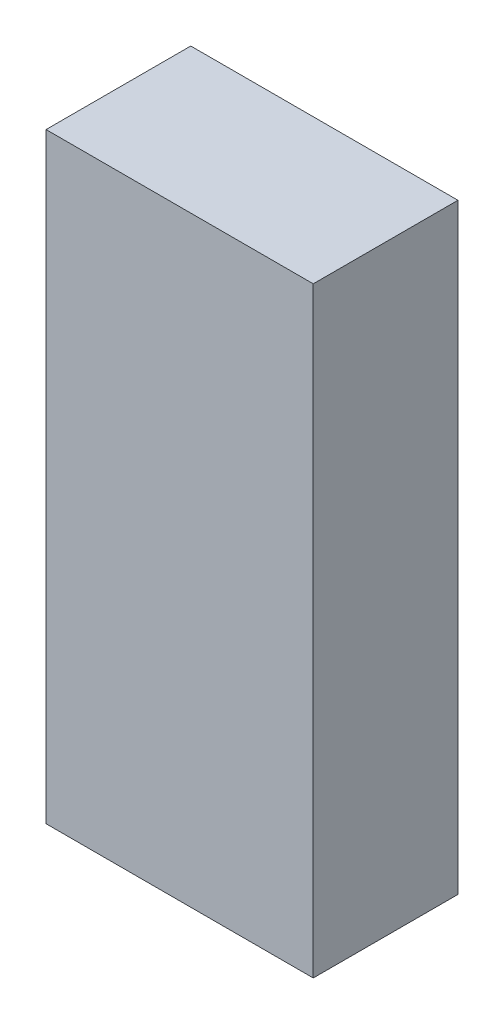
ISO-10303-21;
HEADER;
FILE_DESCRIPTION(('STEP AP214'),'2;1');
FILE_NAME('part.step','',(''),(''),'','','');
FILE_SCHEMA(('AUTOMOTIVE_DESIGN { 1 0 10303 214 1 1 1 1 }'));
ENDSEC;
DATA;
#1=APPLICATION_CONTEXT('core data for automotive mechanical design processes');
#2=APPLICATION_PROTOCOL_DEFINITION('international standard','automotive_design',2000,#1);
#3=PRODUCT_CONTEXT('',#1,'mechanical');
#4=PRODUCT('Part','Part','',(#3));
#5=PRODUCT_RELATED_PRODUCT_CATEGORY('part','',(#4));
#6=PRODUCT_DEFINITION_FORMATION('','',#4);
#7=PRODUCT_DEFINITION_CONTEXT('part definition',#1,'design');
#8=PRODUCT_DEFINITION('design','',#6,#7);
#9=PRODUCT_DEFINITION_SHAPE('','',#8);
#10=(LENGTH_UNIT() NAMED_UNIT(*) SI_UNIT(.MILLI.,.METRE.));
#11=(NAMED_UNIT(*) PLANE_ANGLE_UNIT() SI_UNIT($,.RADIAN.));
#12=(NAMED_UNIT(*) SI_UNIT($,.STERADIAN.) SOLID_ANGLE_UNIT());
#13=UNCERTAINTY_MEASURE_WITH_UNIT(LENGTH_MEASURE(1.E-05),#10,'distance_accuracy_value','');
#14=(GEOMETRIC_REPRESENTATION_CONTEXT(3) GLOBAL_UNCERTAINTY_ASSIGNED_CONTEXT((#13)) GLOBAL_UNIT_ASSIGNED_CONTEXT((#10,
#11,#12)) REPRESENTATION_CONTEXT('',''));
#15=CARTESIAN_POINT('',(0.,0.,0.));
#16=DIRECTION('',(0.,0.,1.));
#17=DIRECTION('',(1.,0.,0.));
#18=AXIS2_PLACEMENT_3D('',#15,#16,#17);
#19=CARTESIAN_POINT('',(0.738632,-1.661922,0.80000094));
#20=DIRECTION('',(0.,0.,1.));
#21=DIRECTION('',(1.,0.,0.));
#22=AXIS2_PLACEMENT_3D('',#19,#20,#21);
#23=PLANE('',#22);
#24=DIRECTION('',(0.,1.,0.));
#25=VECTOR('',#24,1.);
#26=CARTESIAN_POINT('',(-0.738632,-1.661922,0.80000094));
#27=LINE('',#26,#25);
#28=CARTESIAN_POINT('',(-0.738632,-1.661922,0.80000094));
#29=VERTEX_POINT('',#28);
#30=CARTESIAN_POINT('',(-0.738632,1.661922,0.80000094));
#31=VERTEX_POINT('',#30);
#32=EDGE_CURVE('E53',#29,#31,#27,.T.);
#33=ORIENTED_EDGE('',*,*,#32,.F.);
#34=DIRECTION('',(1.,0.,0.));
#35=VECTOR('',#34,1.);
#36=CARTESIAN_POINT('',(0.738632,-1.661922,0.80000094));
#37=LINE('',#36,#35);
#38=CARTESIAN_POINT('',(0.738632,-1.661922,0.80000094));
#39=VERTEX_POINT('',#38);
#40=EDGE_CURVE('E20',#29,#39,#37,.T.);
#41=ORIENTED_EDGE('',*,*,#40,.T.);
#42=DIRECTION('',(0.,1.,0.));
#43=VECTOR('',#42,1.);
#44=CARTESIAN_POINT('',(0.738632,1.661922,0.80000094));
#45=LINE('',#44,#43);
#46=CARTESIAN_POINT('',(0.738632,1.661922,0.80000094));
#47=VERTEX_POINT('',#46);
#48=EDGE_CURVE('E67',#47,#39,#45,.F.);
#49=ORIENTED_EDGE('',*,*,#48,.F.);
#50=DIRECTION('',(1.,0.,0.));
#51=VECTOR('',#50,1.);
#52=CARTESIAN_POINT('',(-0.738632,1.661922,0.80000094));
#53=LINE('',#52,#51);
#54=EDGE_CURVE('E58',#31,#47,#53,.T.);
#55=ORIENTED_EDGE('',*,*,#54,.F.);
#56=EDGE_LOOP('',(#33,#41,#49,#55));
#57=FACE_BOUND('',#56,.T.);
#58=ADVANCED_FACE('F17',(#57),#23,.T.);
#59=CARTESIAN_POINT('',(0.738632,1.661922,0.));
#60=DIRECTION('',(1.,0.,0.));
#61=DIRECTION('',(0.,0.,-1.));
#62=AXIS2_PLACEMENT_3D('',#59,#60,#61);
#63=PLANE('',#62);
#64=DIRECTION('',(0.,0.,-1.));
#65=VECTOR('',#64,1.);
#66=CARTESIAN_POINT('',(0.738632,-1.661922,0.));
#67=LINE('',#66,#65);
#68=CARTESIAN_POINT('',(0.738632,-1.661922,0.));
#69=VERTEX_POINT('',#68);
#70=EDGE_CURVE('E80',#69,#39,#67,.F.);
#71=ORIENTED_EDGE('',*,*,#70,.F.);
#72=DIRECTION('',(0.,1.,0.));
#73=VECTOR('',#72,1.);
#74=CARTESIAN_POINT('',(0.738632,-1.661922,0.));
#75=LINE('',#74,#73);
#76=CARTESIAN_POINT('',(0.738632,1.661922,0.));
#77=VERTEX_POINT('',#76);
#78=EDGE_CURVE('E75',#69,#77,#75,.T.);
#79=ORIENTED_EDGE('',*,*,#78,.T.);
#80=DIRECTION('',(0.,0.,1.));
#81=VECTOR('',#80,1.);
#82=CARTESIAN_POINT('',(0.738632,1.661922,0.));
#83=LINE('',#82,#81);
#84=EDGE_CURVE('E63',#47,#77,#83,.F.);
#85=ORIENTED_EDGE('',*,*,#84,.F.);
#86=ORIENTED_EDGE('',*,*,#48,.T.);
#87=EDGE_LOOP('',(#71,#79,#85,#86));
#88=FACE_BOUND('',#87,.T.);
#89=ADVANCED_FACE('F74',(#88),#63,.T.);
#90=CARTESIAN_POINT('',(-0.738632,1.661922,0.));
#91=DIRECTION('',(0.,1.,0.));
#92=DIRECTION('',(0.,0.,1.));
#93=AXIS2_PLACEMENT_3D('',#90,#91,#92);
#94=PLANE('',#93);
#95=ORIENTED_EDGE('',*,*,#84,.T.);
#96=DIRECTION('',(1.,0.,0.));
#97=VECTOR('',#96,1.);
#98=CARTESIAN_POINT('',(0.738632,1.661922,0.));
#99=LINE('',#98,#97);
#100=CARTESIAN_POINT('',(-0.738632,1.661922,0.));
#101=VERTEX_POINT('',#100);
#102=EDGE_CURVE('E84',#77,#101,#99,.F.);
#103=ORIENTED_EDGE('',*,*,#102,.T.);
#104=DIRECTION('',(0.,0.,1.));
#105=VECTOR('',#104,1.);
#106=CARTESIAN_POINT('',(-0.738632,1.661922,0.));
#107=LINE('',#106,#105);
#108=EDGE_CURVE('E65',#31,#101,#107,.F.);
#109=ORIENTED_EDGE('',*,*,#108,.F.);
#110=ORIENTED_EDGE('',*,*,#54,.T.);
#111=EDGE_LOOP('',(#95,#103,#109,#110));
#112=FACE_BOUND('',#111,.T.);
#113=ADVANCED_FACE('F60',(#112),#94,.T.);
#114=CARTESIAN_POINT('',(-0.738632,-1.661922,0.));
#115=DIRECTION('',(-1.,0.,0.));
#116=DIRECTION('',(0.,0.,1.));
#117=AXIS2_PLACEMENT_3D('',#114,#115,#116);
#118=PLANE('',#117);
#119=ORIENTED_EDGE('',*,*,#108,.T.);
#120=DIRECTION('',(0.,1.,0.));
#121=VECTOR('',#120,1.);
#122=CARTESIAN_POINT('',(-0.738632,-1.661922,0.));
#123=LINE('',#122,#121);
#124=CARTESIAN_POINT('',(-0.738632,-1.661922,0.));
#125=VERTEX_POINT('',#124);
#126=EDGE_CURVE('E26',#101,#125,#123,.F.);
#127=ORIENTED_EDGE('',*,*,#126,.T.);
#128=DIRECTION('',(0.,0.,-1.));
#129=VECTOR('',#128,1.);
#130=CARTESIAN_POINT('',(-0.738632,-1.661922,0.));
#131=LINE('',#130,#129);
#132=EDGE_CURVE('E34',#29,#125,#131,.T.);
#133=ORIENTED_EDGE('',*,*,#132,.F.);
#134=ORIENTED_EDGE('',*,*,#32,.T.);
#135=EDGE_LOOP('',(#119,#127,#133,#134));
#136=FACE_BOUND('',#135,.T.);
#137=ADVANCED_FACE('F88',(#136),#118,.T.);
#138=CARTESIAN_POINT('',(0.738632,-1.661922,0.));
#139=DIRECTION('',(0.,-1.,0.));
#140=DIRECTION('',(0.,0.,-1.));
#141=AXIS2_PLACEMENT_3D('',#138,#139,#140);
#142=PLANE('',#141);
#143=ORIENTED_EDGE('',*,*,#132,.T.);
#144=DIRECTION('',(1.,0.,0.));
#145=VECTOR('',#144,1.);
#146=CARTESIAN_POINT('',(0.738632,-1.661922,0.));
#147=LINE('',#146,#145);
#148=EDGE_CURVE('E11',#125,#69,#147,.T.);
#149=ORIENTED_EDGE('',*,*,#148,.T.);
#150=ORIENTED_EDGE('',*,*,#70,.T.);
#151=ORIENTED_EDGE('',*,*,#40,.F.);
#152=EDGE_LOOP('',(#143,#149,#150,#151));
#153=FACE_BOUND('',#152,.T.);
#154=ADVANCED_FACE('F91',(#153),#142,.T.);
#155=CARTESIAN_POINT('',(0.738632,-1.661922,0.));
#156=DIRECTION('',(0.,0.,1.));
#157=DIRECTION('',(1.,0.,0.));
#158=AXIS2_PLACEMENT_3D('',#155,#156,#157);
#159=PLANE('',#158);
#160=ORIENTED_EDGE('',*,*,#126,.F.);
#161=ORIENTED_EDGE('',*,*,#102,.F.);
#162=ORIENTED_EDGE('',*,*,#78,.F.);
#163=ORIENTED_EDGE('',*,*,#148,.F.);
#164=EDGE_LOOP('',(#160,#161,#162,#163));
#165=FACE_BOUND('',#164,.T.);
#166=ADVANCED_FACE('F90',(#165),#159,.F.);
#167=CLOSED_SHELL('',(#58,#89,#113,#137,#154,#166));
#168=MANIFOLD_SOLID_BREP('B1',#167);
#169=ADVANCED_BREP_SHAPE_REPRESENTATION('',(#18,#168),#14);
#170=SHAPE_DEFINITION_REPRESENTATION(#9,#169);
ENDSEC;
END-ISO-10303-21;
